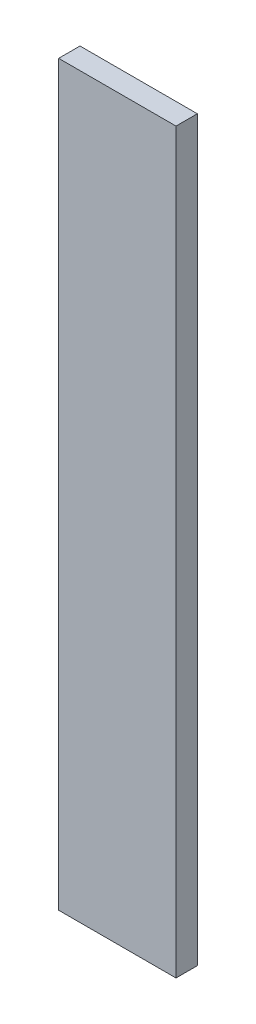
ISO-10303-21;
HEADER;
FILE_DESCRIPTION(('STEP AP214'),'2;1');
FILE_NAME('part.step','',(''),(''),'','','');
FILE_SCHEMA(('AUTOMOTIVE_DESIGN { 1 0 10303 214 1 1 1 1 }'));
ENDSEC;
DATA;
#1=APPLICATION_CONTEXT('core data for automotive mechanical design processes');
#2=APPLICATION_PROTOCOL_DEFINITION('international standard','automotive_design',2000,#1);
#3=PRODUCT_CONTEXT('',#1,'mechanical');
#4=PRODUCT('Part','Part','',(#3));
#5=PRODUCT_RELATED_PRODUCT_CATEGORY('part','',(#4));
#6=PRODUCT_DEFINITION_FORMATION('','',#4);
#7=PRODUCT_DEFINITION_CONTEXT('part definition',#1,'design');
#8=PRODUCT_DEFINITION('design','',#6,#7);
#9=PRODUCT_DEFINITION_SHAPE('','',#8);
#10=(LENGTH_UNIT() NAMED_UNIT(*) SI_UNIT(.MILLI.,.METRE.));
#11=(NAMED_UNIT(*) PLANE_ANGLE_UNIT() SI_UNIT($,.RADIAN.));
#12=(NAMED_UNIT(*) SI_UNIT($,.STERADIAN.) SOLID_ANGLE_UNIT());
#13=UNCERTAINTY_MEASURE_WITH_UNIT(LENGTH_MEASURE(1.E-05),#10,'distance_accuracy_value','');
#14=(GEOMETRIC_REPRESENTATION_CONTEXT(3) GLOBAL_UNCERTAINTY_ASSIGNED_CONTEXT((#13)) GLOBAL_UNIT_ASSIGNED_CONTEXT((#10,
#11,#12)) REPRESENTATION_CONTEXT('',''));
#15=CARTESIAN_POINT('',(0.,0.,0.));
#16=DIRECTION('',(0.,0.,1.));
#17=DIRECTION('',(1.,0.,0.));
#18=AXIS2_PLACEMENT_3D('',#15,#16,#17);
#19=CARTESIAN_POINT('',(0.,395.,-6.));
#20=DIRECTION('',(0.,1.,0.));
#21=DIRECTION('',(-1.,0.,0.));
#22=AXIS2_PLACEMENT_3D('',#19,#20,#21);
#23=PLANE('',#22);
#24=DIRECTION('',(-1.,0.,0.));
#25=VECTOR('',#24,1.);
#26=CARTESIAN_POINT('',(0.,395.,-6.));
#27=LINE('',#26,#25);
#28=CARTESIAN_POINT('',(13.,395.,-6.));
#29=VERTEX_POINT('',#28);
#30=CARTESIAN_POINT('',(-23.,395.,-6.));
#31=VERTEX_POINT('',#30);
#32=EDGE_CURVE('E57',#29,#31,#27,.T.);
#33=ORIENTED_EDGE('',*,*,#32,.F.);
#34=DIRECTION('',(0.,0.,-1.));
#35=VECTOR('',#34,1.);
#36=CARTESIAN_POINT('',(13.,395.,28.2842712474619));
#37=LINE('',#36,#35);
#38=CARTESIAN_POINT('',(13.,395.,0.));
#39=VERTEX_POINT('',#38);
#40=EDGE_CURVE('E49',#29,#39,#37,.F.);
#41=ORIENTED_EDGE('',*,*,#40,.T.);
#42=DIRECTION('',(-1.,0.,0.));
#43=VECTOR('',#42,1.);
#44=CARTESIAN_POINT('',(0.,395.,0.));
#45=LINE('',#44,#43);
#46=CARTESIAN_POINT('',(-23.,395.,0.));
#47=VERTEX_POINT('',#46);
#48=EDGE_CURVE('E69',#39,#47,#45,.T.);
#49=ORIENTED_EDGE('',*,*,#48,.T.);
#50=DIRECTION('',(0.,0.,1.));
#51=VECTOR('',#50,1.);
#52=CARTESIAN_POINT('',(-23.,395.,-6.));
#53=LINE('',#52,#51);
#54=EDGE_CURVE('E11',#31,#47,#53,.T.);
#55=ORIENTED_EDGE('',*,*,#54,.F.);
#56=EDGE_LOOP('',(#33,#41,#49,#55));
#57=FACE_BOUND('',#56,.T.);
#58=ADVANCED_FACE('F33',(#57),#23,.F.);
#59=CARTESIAN_POINT('',(-23.,0.,-6.));
#60=DIRECTION('',(1.,0.,0.));
#61=DIRECTION('',(0.,1.,0.));
#62=AXIS2_PLACEMENT_3D('',#59,#60,#61);
#63=PLANE('',#62);
#64=ORIENTED_EDGE('',*,*,#54,.T.);
#65=DIRECTION('',(0.,-1.,0.));
#66=VECTOR('',#65,1.);
#67=CARTESIAN_POINT('',(-23.,415.,0.));
#68=LINE('',#67,#66);
#69=CARTESIAN_POINT('',(-23.,0.,0.));
#70=VERTEX_POINT('',#69);
#71=EDGE_CURVE('E143',#47,#70,#68,.T.);
#72=ORIENTED_EDGE('',*,*,#71,.T.);
#73=DIRECTION('',(0.,0.,-1.));
#74=VECTOR('',#73,1.);
#75=CARTESIAN_POINT('',(-23.,0.,6.));
#76=LINE('',#75,#74);
#77=CARTESIAN_POINT('',(-23.,0.,6.));
#78=VERTEX_POINT('',#77);
#79=EDGE_CURVE('E126',#78,#70,#76,.T.);
#80=ORIENTED_EDGE('',*,*,#79,.F.);
#81=DIRECTION('',(0.,-1.,0.));
#82=VECTOR('',#81,1.);
#83=CARTESIAN_POINT('',(-23.,415.,6.));
#84=LINE('',#83,#82);
#85=CARTESIAN_POINT('',(-23.,415.,6.));
#86=VERTEX_POINT('',#85);
#87=EDGE_CURVE('E152',#86,#78,#84,.T.);
#88=ORIENTED_EDGE('',*,*,#87,.F.);
#89=DIRECTION('',(0.,0.,1.));
#90=VECTOR('',#89,1.);
#91=CARTESIAN_POINT('',(-23.,415.,-6.));
#92=LINE('',#91,#90);
#93=CARTESIAN_POINT('',(-23.,415.,-6.));
#94=VERTEX_POINT('',#93);
#95=EDGE_CURVE('E41',#94,#86,#92,.T.);
#96=ORIENTED_EDGE('',*,*,#95,.F.);
#97=DIRECTION('',(0.,1.,0.));
#98=VECTOR('',#97,1.);
#99=CARTESIAN_POINT('',(-23.,0.,-6.));
#100=LINE('',#99,#98);
#101=EDGE_CURVE('E100',#31,#94,#100,.T.);
#102=ORIENTED_EDGE('',*,*,#101,.F.);
#103=EDGE_LOOP('',(#64,#72,#80,#88,#96,#102));
#104=FACE_BOUND('',#103,.T.);
#105=ADVANCED_FACE('F170',(#104),#63,.F.);
#106=CARTESIAN_POINT('',(0.,415.,-6.));
#107=DIRECTION('',(0.,-1.,0.));
#108=DIRECTION('',(1.,0.,0.));
#109=AXIS2_PLACEMENT_3D('',#106,#107,#108);
#110=PLANE('',#109);
#111=ORIENTED_EDGE('',*,*,#95,.T.);
#112=DIRECTION('',(-1.,0.,0.));
#113=VECTOR('',#112,1.);
#114=CARTESIAN_POINT('',(43.,415.,6.));
#115=LINE('',#114,#113);
#116=CARTESIAN_POINT('',(43.,415.,6.));
#117=VERTEX_POINT('',#116);
#118=EDGE_CURVE('E111',#117,#86,#115,.T.);
#119=ORIENTED_EDGE('',*,*,#118,.F.);
#120=DIRECTION('',(0.,0.,1.));
#121=VECTOR('',#120,1.);
#122=CARTESIAN_POINT('',(43.,415.,-6.));
#123=LINE('',#122,#121);
#124=CARTESIAN_POINT('',(43.,415.,-6.));
#125=VERTEX_POINT('',#124);
#126=EDGE_CURVE('E107',#125,#117,#123,.T.);
#127=ORIENTED_EDGE('',*,*,#126,.F.);
#128=DIRECTION('',(1.,0.,0.));
#129=VECTOR('',#128,1.);
#130=CARTESIAN_POINT('',(0.,415.,-6.));
#131=LINE('',#130,#129);
#132=EDGE_CURVE('E92',#94,#125,#131,.T.);
#133=ORIENTED_EDGE('',*,*,#132,.F.);
#134=EDGE_LOOP('',(#111,#119,#127,#133));
#135=FACE_BOUND('',#134,.T.);
#136=ADVANCED_FACE('F108',(#135),#110,.F.);
#137=CARTESIAN_POINT('',(43.,0.,-6.));
#138=DIRECTION('',(1.,0.,0.));
#139=DIRECTION('',(0.,1.,0.));
#140=AXIS2_PLACEMENT_3D('',#137,#138,#139);
#141=PLANE('',#140);
#142=ORIENTED_EDGE('',*,*,#126,.T.);
#143=DIRECTION('',(0.,1.,0.));
#144=VECTOR('',#143,1.);
#145=CARTESIAN_POINT('',(43.,415.,6.));
#146=LINE('',#145,#144);
#147=CARTESIAN_POINT('',(43.,0.,6.));
#148=VERTEX_POINT('',#147);
#149=EDGE_CURVE('E142',#148,#117,#146,.T.);
#150=ORIENTED_EDGE('',*,*,#149,.F.);
#151=DIRECTION('',(0.,0.,1.));
#152=VECTOR('',#151,1.);
#153=CARTESIAN_POINT('',(43.,0.,-6.));
#154=LINE('',#153,#152);
#155=CARTESIAN_POINT('',(43.,0.,-6.));
#156=VERTEX_POINT('',#155);
#157=EDGE_CURVE('E115',#156,#148,#154,.T.);
#158=ORIENTED_EDGE('',*,*,#157,.F.);
#159=DIRECTION('',(0.,1.,0.));
#160=VECTOR('',#159,1.);
#161=CARTESIAN_POINT('',(43.,0.,-6.));
#162=LINE('',#161,#160);
#163=EDGE_CURVE('E98',#156,#125,#162,.T.);
#164=ORIENTED_EDGE('',*,*,#163,.T.);
#165=EDGE_LOOP('',(#142,#150,#158,#164));
#166=FACE_BOUND('',#165,.T.);
#167=ADVANCED_FACE('F117',(#166),#141,.T.);
#168=CARTESIAN_POINT('',(0.,0.,-6.));
#169=DIRECTION('',(0.,-1.,0.));
#170=DIRECTION('',(1.,0.,0.));
#171=AXIS2_PLACEMENT_3D('',#168,#169,#170);
#172=PLANE('',#171);
#173=ORIENTED_EDGE('',*,*,#157,.T.);
#174=DIRECTION('',(1.,0.,0.));
#175=VECTOR('',#174,1.);
#176=CARTESIAN_POINT('',(43.,0.,6.));
#177=LINE('',#176,#175);
#178=EDGE_CURVE('E151',#78,#148,#177,.T.);
#179=ORIENTED_EDGE('',*,*,#178,.F.);
#180=ORIENTED_EDGE('',*,*,#79,.T.);
#181=DIRECTION('',(1.,0.,0.));
#182=VECTOR('',#181,1.);
#183=CARTESIAN_POINT('',(43.,0.,0.));
#184=LINE('',#183,#182);
#185=CARTESIAN_POINT('',(23.,0.,0.));
#186=VERTEX_POINT('',#185);
#187=EDGE_CURVE('E138',#70,#186,#184,.T.);
#188=ORIENTED_EDGE('',*,*,#187,.T.);
#189=DIRECTION('',(0.,0.,1.));
#190=VECTOR('',#189,1.);
#191=CARTESIAN_POINT('',(23.,0.,-6.));
#192=LINE('',#191,#190);
#193=CARTESIAN_POINT('',(23.,0.,-6.));
#194=VERTEX_POINT('',#193);
#195=EDGE_CURVE('E36',#194,#186,#192,.T.);
#196=ORIENTED_EDGE('',*,*,#195,.F.);
#197=DIRECTION('',(1.,0.,0.));
#198=VECTOR('',#197,1.);
#199=CARTESIAN_POINT('',(0.,0.,-6.));
#200=LINE('',#199,#198);
#201=EDGE_CURVE('E118',#194,#156,#200,.T.);
#202=ORIENTED_EDGE('',*,*,#201,.T.);
#203=EDGE_LOOP('',(#173,#179,#180,#188,#196,#202));
#204=FACE_BOUND('',#203,.T.);
#205=ADVANCED_FACE('F139',(#204),#172,.T.);
#206=CARTESIAN_POINT('',(23.,0.,-6.));
#207=DIRECTION('',(-1.,0.,0.));
#208=DIRECTION('',(0.,-1.,0.));
#209=AXIS2_PLACEMENT_3D('',#206,#207,#208);
#210=PLANE('',#209);
#211=DIRECTION('',(0.,0.,-1.));
#212=VECTOR('',#211,1.);
#213=CARTESIAN_POINT('',(23.,385.,28.2842712474619));
#214=LINE('',#213,#212);
#215=CARTESIAN_POINT('',(23.,385.,-6.));
#216=VERTEX_POINT('',#215);
#217=CARTESIAN_POINT('',(23.,385.,0.));
#218=VERTEX_POINT('',#217);
#219=EDGE_CURVE('E159',#216,#218,#214,.F.);
#220=ORIENTED_EDGE('',*,*,#219,.F.);
#221=DIRECTION('',(0.,-1.,0.));
#222=VECTOR('',#221,1.);
#223=CARTESIAN_POINT('',(23.,0.,-6.));
#224=LINE('',#223,#222);
#225=EDGE_CURVE('E120',#216,#194,#224,.T.);
#226=ORIENTED_EDGE('',*,*,#225,.T.);
#227=ORIENTED_EDGE('',*,*,#195,.T.);
#228=DIRECTION('',(0.,-1.,0.));
#229=VECTOR('',#228,1.);
#230=CARTESIAN_POINT('',(23.,0.,0.));
#231=LINE('',#230,#229);
#232=EDGE_CURVE('E80',#218,#186,#231,.T.);
#233=ORIENTED_EDGE('',*,*,#232,.F.);
#234=EDGE_LOOP('',(#220,#226,#227,#233));
#235=FACE_BOUND('',#234,.T.);
#236=ADVANCED_FACE('F135',(#235),#210,.T.);
#237=CARTESIAN_POINT('',(0.,0.,-6.));
#238=DIRECTION('',(0.,0.,1.));
#239=DIRECTION('',(1.,0.,0.));
#240=AXIS2_PLACEMENT_3D('',#237,#238,#239);
#241=PLANE('',#240);
#242=ORIENTED_EDGE('',*,*,#225,.F.);
#243=CARTESIAN_POINT('',(23.,395.,-6.));
#244=DIRECTION('',(0.,0.,-1.));
#245=DIRECTION('',(-1.,0.,0.));
#246=AXIS2_PLACEMENT_3D('',#243,#244,#245);
#247=CIRCLE('',#246,10.);
#248=EDGE_CURVE('E164',#29,#216,#247,.T.);
#249=ORIENTED_EDGE('',*,*,#248,.F.);
#250=ORIENTED_EDGE('',*,*,#32,.T.);
#251=ORIENTED_EDGE('',*,*,#101,.T.);
#252=ORIENTED_EDGE('',*,*,#132,.T.);
#253=ORIENTED_EDGE('',*,*,#163,.F.);
#254=ORIENTED_EDGE('',*,*,#201,.F.);
#255=EDGE_LOOP('',(#242,#249,#250,#251,#252,#253,#254));
#256=FACE_BOUND('',#255,.T.);
#257=ADVANCED_FACE('F95',(#256),#241,.F.);
#258=CARTESIAN_POINT('',(0.,0.,0.));
#259=DIRECTION('',(0.,0.,-1.));
#260=DIRECTION('',(-1.,0.,0.));
#261=AXIS2_PLACEMENT_3D('',#258,#259,#260);
#262=PLANE('',#261);
#263=ORIENTED_EDGE('',*,*,#48,.F.);
#264=CARTESIAN_POINT('',(23.,395.,0.));
#265=DIRECTION('',(0.,0.,-1.));
#266=DIRECTION('',(-1.,0.,0.));
#267=AXIS2_PLACEMENT_3D('',#264,#265,#266);
#268=CIRCLE('',#267,10.);
#269=EDGE_CURVE('E162',#218,#39,#268,.F.);
#270=ORIENTED_EDGE('',*,*,#269,.F.);
#271=ORIENTED_EDGE('',*,*,#232,.T.);
#272=ORIENTED_EDGE('',*,*,#187,.F.);
#273=ORIENTED_EDGE('',*,*,#71,.F.);
#274=EDGE_LOOP('',(#263,#270,#271,#272,#273));
#275=FACE_BOUND('',#274,.T.);
#276=ADVANCED_FACE('F171',(#275),#262,.T.);
#277=CARTESIAN_POINT('',(0.,0.,6.));
#278=DIRECTION('',(0.,0.,-1.));
#279=DIRECTION('',(-1.,0.,0.));
#280=AXIS2_PLACEMENT_3D('',#277,#278,#279);
#281=PLANE('',#280);
#282=ORIENTED_EDGE('',*,*,#149,.T.);
#283=ORIENTED_EDGE('',*,*,#118,.T.);
#284=ORIENTED_EDGE('',*,*,#87,.T.);
#285=ORIENTED_EDGE('',*,*,#178,.T.);
#286=EDGE_LOOP('',(#282,#283,#284,#285));
#287=FACE_BOUND('',#286,.T.);
#288=ADVANCED_FACE('F179',(#287),#281,.F.);
#289=CARTESIAN_POINT('',(23.,395.,28.2842712474619));
#290=DIRECTION('',(0.,0.,-1.));
#291=DIRECTION('',(-1.,0.,0.));
#292=AXIS2_PLACEMENT_3D('',#289,#290,#291);
#293=CYLINDRICAL_SURFACE('',#292,10.);
#294=ORIENTED_EDGE('',*,*,#248,.T.);
#295=ORIENTED_EDGE('',*,*,#219,.T.);
#296=ORIENTED_EDGE('',*,*,#269,.T.);
#297=ORIENTED_EDGE('',*,*,#40,.F.);
#298=EDGE_LOOP('',(#294,#295,#296,#297));
#299=FACE_BOUND('',#298,.T.);
#300=ADVANCED_FACE('F166',(#299),#293,.F.);
#301=CLOSED_SHELL('',(#58,#105,#136,#167,#205,#236,#257,#276,#288,#300));
#302=MANIFOLD_SOLID_BREP('B2',#301);
#303=ADVANCED_BREP_SHAPE_REPRESENTATION('',(#18,#302),#14);
#304=SHAPE_DEFINITION_REPRESENTATION(#9,#303);
ENDSEC;
END-ISO-10303-21;
